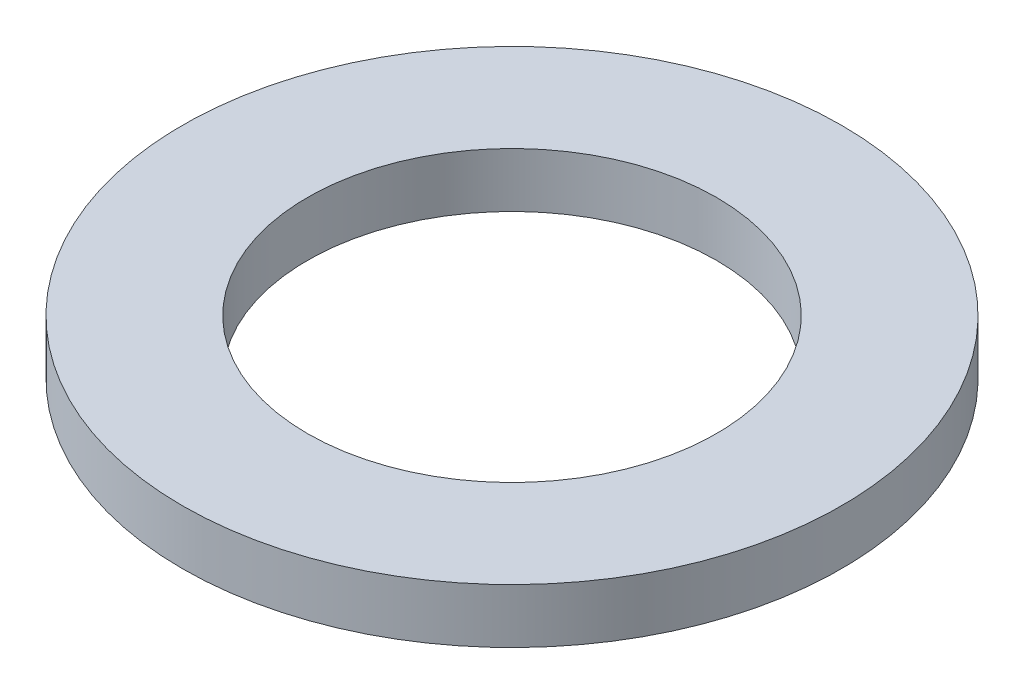
ISO-10303-21;
HEADER;
FILE_DESCRIPTION(('STEP AP214'),'2;1');
FILE_NAME('part.step','',(''),(''),'','','');
FILE_SCHEMA(('AUTOMOTIVE_DESIGN { 1 0 10303 214 1 1 1 1 }'));
ENDSEC;
DATA;
#1=APPLICATION_CONTEXT('core data for automotive mechanical design processes');
#2=APPLICATION_PROTOCOL_DEFINITION('international standard','automotive_design',2000,#1);
#3=PRODUCT_CONTEXT('',#1,'mechanical');
#4=PRODUCT('Part','Part','',(#3));
#5=PRODUCT_RELATED_PRODUCT_CATEGORY('part','',(#4));
#6=PRODUCT_DEFINITION_FORMATION('','',#4);
#7=PRODUCT_DEFINITION_CONTEXT('part definition',#1,'design');
#8=PRODUCT_DEFINITION('design','',#6,#7);
#9=PRODUCT_DEFINITION_SHAPE('','',#8);
#10=(LENGTH_UNIT() NAMED_UNIT(*) SI_UNIT(.MILLI.,.METRE.));
#11=(NAMED_UNIT(*) PLANE_ANGLE_UNIT() SI_UNIT($,.RADIAN.));
#12=(NAMED_UNIT(*) SI_UNIT($,.STERADIAN.) SOLID_ANGLE_UNIT());
#13=UNCERTAINTY_MEASURE_WITH_UNIT(LENGTH_MEASURE(1.E-05),#10,'distance_accuracy_value','');
#14=(GEOMETRIC_REPRESENTATION_CONTEXT(3) GLOBAL_UNCERTAINTY_ASSIGNED_CONTEXT((#13)) GLOBAL_UNIT_ASSIGNED_CONTEXT((#10,
#11,#12)) REPRESENTATION_CONTEXT('',''));
#15=CARTESIAN_POINT('',(0.,0.,0.));
#16=DIRECTION('',(0.,0.,1.));
#17=DIRECTION('',(1.,0.,0.));
#18=AXIS2_PLACEMENT_3D('',#15,#16,#17);
#19=CARTESIAN_POINT('',(0.,12.,0.));
#20=DIRECTION('',(0.,-1.,0.));
#21=DIRECTION('',(0.,0.,-1.));
#22=AXIS2_PLACEMENT_3D('',#19,#20,#21);
#23=CYLINDRICAL_SURFACE('',#22,72.5);
#24=CARTESIAN_POINT('',(0.,12.,0.));
#25=DIRECTION('',(0.,1.,0.));
#26=DIRECTION('',(0.,0.,1.));
#27=AXIS2_PLACEMENT_3D('',#24,#25,#26);
#28=CIRCLE('',#27,72.5);
#29=CARTESIAN_POINT('',(0.,12.,72.5));
#30=VERTEX_POINT('',#29);
#31=EDGE_CURVE('E10',#30,#30,#28,.T.);
#32=ORIENTED_EDGE('',*,*,#31,.F.);
#33=EDGE_LOOP('',(#32));
#34=FACE_BOUND('',#33,.T.);
#35=CARTESIAN_POINT('',(0.,0.,0.));
#36=DIRECTION('',(0.,1.,0.));
#37=DIRECTION('',(0.,0.,1.));
#38=AXIS2_PLACEMENT_3D('',#35,#36,#37);
#39=CIRCLE('',#38,72.5);
#40=CARTESIAN_POINT('',(0.,0.,72.5));
#41=VERTEX_POINT('',#40);
#42=EDGE_CURVE('E37',#41,#41,#39,.T.);
#43=ORIENTED_EDGE('',*,*,#42,.T.);
#44=EDGE_LOOP('',(#43));
#45=FACE_BOUND('',#44,.T.);
#46=ADVANCED_FACE('F40',(#34,#45),#23,.T.);
#47=CARTESIAN_POINT('',(0.,12.,0.));
#48=DIRECTION('',(0.,1.,0.));
#49=DIRECTION('',(0.,0.,1.));
#50=AXIS2_PLACEMENT_3D('',#47,#48,#49);
#51=PLANE('',#50);
#52=CARTESIAN_POINT('',(0.,12.,0.));
#53=DIRECTION('',(0.,1.,0.));
#54=DIRECTION('',(0.,0.,1.));
#55=AXIS2_PLACEMENT_3D('',#52,#53,#54);
#56=CIRCLE('',#55,45.);
#57=CARTESIAN_POINT('',(0.,12.,45.));
#58=VERTEX_POINT('',#57);
#59=EDGE_CURVE('E50',#58,#58,#56,.T.);
#60=ORIENTED_EDGE('',*,*,#59,.F.);
#61=EDGE_LOOP('',(#60));
#62=FACE_BOUND('',#61,.T.);
#63=ORIENTED_EDGE('',*,*,#31,.T.);
#64=EDGE_LOOP('',(#63));
#65=FACE_BOUND('',#64,.T.);
#66=ADVANCED_FACE('F59',(#62,#65),#51,.T.);
#67=CARTESIAN_POINT('',(0.,0.,0.));
#68=DIRECTION('',(0.,1.,0.));
#69=DIRECTION('',(0.,0.,1.));
#70=AXIS2_PLACEMENT_3D('',#67,#68,#69);
#71=PLANE('',#70);
#72=CARTESIAN_POINT('',(0.,0.,0.));
#73=DIRECTION('',(0.,1.,0.));
#74=DIRECTION('',(0.,0.,1.));
#75=AXIS2_PLACEMENT_3D('',#72,#73,#74);
#76=CIRCLE('',#75,45.);
#77=CARTESIAN_POINT('',(0.,0.,45.));
#78=VERTEX_POINT('',#77);
#79=EDGE_CURVE('E47',#78,#78,#76,.T.);
#80=ORIENTED_EDGE('',*,*,#79,.T.);
#81=EDGE_LOOP('',(#80));
#82=FACE_BOUND('',#81,.T.);
#83=ORIENTED_EDGE('',*,*,#42,.F.);
#84=EDGE_LOOP('',(#83));
#85=FACE_BOUND('',#84,.T.);
#86=ADVANCED_FACE('F58',(#82,#85),#71,.F.);
#87=CARTESIAN_POINT('',(0.,12.,0.));
#88=DIRECTION('',(0.,-1.,0.));
#89=DIRECTION('',(0.,0.,-1.));
#90=AXIS2_PLACEMENT_3D('',#87,#88,#89);
#91=CYLINDRICAL_SURFACE('',#90,45.);
#92=ORIENTED_EDGE('',*,*,#59,.T.);
#93=EDGE_LOOP('',(#92));
#94=FACE_BOUND('',#93,.T.);
#95=ORIENTED_EDGE('',*,*,#79,.F.);
#96=EDGE_LOOP('',(#95));
#97=FACE_BOUND('',#96,.T.);
#98=ADVANCED_FACE('F54',(#94,#97),#91,.F.);
#99=CLOSED_SHELL('',(#46,#66,#86,#98));
#100=MANIFOLD_SOLID_BREP('B2',#99);
#101=ADVANCED_BREP_SHAPE_REPRESENTATION('',(#18,#100),#14);
#102=SHAPE_DEFINITION_REPRESENTATION(#9,#101);
ENDSEC;
END-ISO-10303-21;
